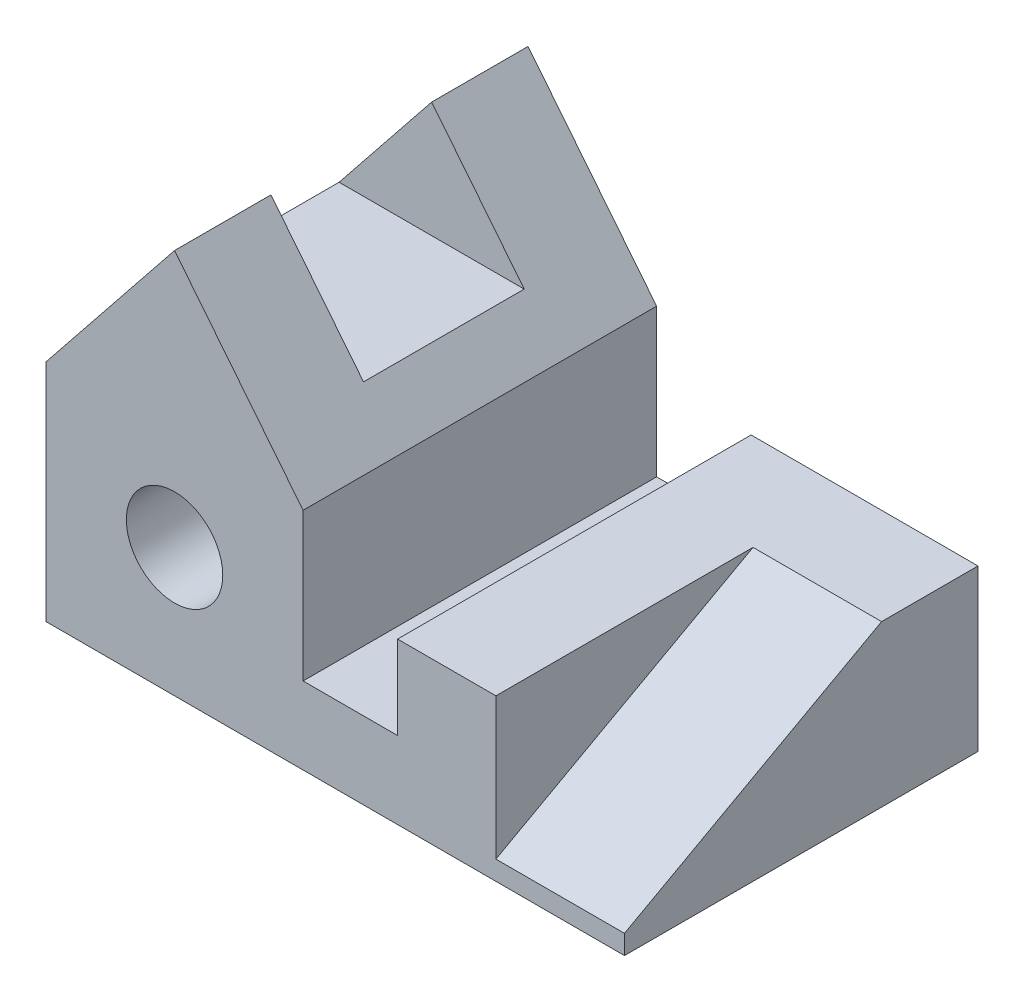
ISO-10303-21;
HEADER;
FILE_DESCRIPTION(('STEP AP214'),'2;1');
FILE_NAME('part.step','',(''),(''),'','','');
FILE_SCHEMA(('AUTOMOTIVE_DESIGN { 1 0 10303 214 1 1 1 1 }'));
ENDSEC;
DATA;
#1=APPLICATION_CONTEXT('core data for automotive mechanical design processes');
#2=APPLICATION_PROTOCOL_DEFINITION('international standard','automotive_design',2000,#1);
#3=PRODUCT_CONTEXT('',#1,'mechanical');
#4=PRODUCT('Part','Part','',(#3));
#5=PRODUCT_RELATED_PRODUCT_CATEGORY('part','',(#4));
#6=PRODUCT_DEFINITION_FORMATION('','',#4);
#7=PRODUCT_DEFINITION_CONTEXT('part definition',#1,'design');
#8=PRODUCT_DEFINITION('design','',#6,#7);
#9=PRODUCT_DEFINITION_SHAPE('','',#8);
#10=(LENGTH_UNIT() NAMED_UNIT(*) SI_UNIT(.MILLI.,.METRE.));
#11=(NAMED_UNIT(*) PLANE_ANGLE_UNIT() SI_UNIT($,.RADIAN.));
#12=(NAMED_UNIT(*) SI_UNIT($,.STERADIAN.) SOLID_ANGLE_UNIT());
#13=UNCERTAINTY_MEASURE_WITH_UNIT(LENGTH_MEASURE(1.E-05),#10,'distance_accuracy_value','');
#14=(GEOMETRIC_REPRESENTATION_CONTEXT(3) GLOBAL_UNCERTAINTY_ASSIGNED_CONTEXT((#13)) GLOBAL_UNIT_ASSIGNED_CONTEXT((#10,
#11,#12)) REPRESENTATION_CONTEXT('',''));
#15=CARTESIAN_POINT('',(0.,0.,0.));
#16=DIRECTION('',(0.,0.,1.));
#17=DIRECTION('',(1.,0.,0.));
#18=AXIS2_PLACEMENT_3D('',#15,#16,#17);
#19=CARTESIAN_POINT('',(-127.,889.,4551.25489909493));
#20=DIRECTION('',(0.78086880944303,0.624695047554424,0.));
#21=DIRECTION('',(-0.624695047554424,0.78086880944303,0.));
#22=AXIS2_PLACEMENT_3D('',#19,#20,#21);
#23=PLANE('',#22);
#24=DIRECTION('',(0.,0.,-1.));
#25=VECTOR('',#24,1.);
#26=CARTESIAN_POINT('',(-269.24,1066.8,317.5));
#27=LINE('',#26,#25);
#28=CARTESIAN_POINT('',(-269.24,1066.8,317.5));
#29=VERTEX_POINT('',#28);
#30=CARTESIAN_POINT('',(-269.24,1066.8,-317.5));
#31=VERTEX_POINT('',#30);
#32=EDGE_CURVE('E250',#29,#31,#27,.T.);
#33=ORIENTED_EDGE('',*,*,#32,.F.);
#34=DIRECTION('',(-0.624695047554424,0.78086880944303,0.));
#35=VECTOR('',#34,1.);
#36=CARTESIAN_POINT('',(-269.24,1066.8,317.5));
#37=LINE('',#36,#35);
#38=CARTESIAN_POINT('',(-635.,1524.,317.5));
#39=VERTEX_POINT('',#38);
#40=EDGE_CURVE('E239',#29,#39,#37,.T.);
#41=ORIENTED_EDGE('',*,*,#40,.T.);
#42=DIRECTION('',(0.,0.,-1.));
#43=VECTOR('',#42,1.);
#44=CARTESIAN_POINT('',(-635.,1524.,4551.25489909493));
#45=LINE('',#44,#43);
#46=CARTESIAN_POINT('',(-635.,1524.,698.5));
#47=VERTEX_POINT('',#46);
#48=EDGE_CURVE('E303',#47,#39,#45,.T.);
#49=ORIENTED_EDGE('',*,*,#48,.F.);
#50=DIRECTION('',(0.624695047554424,-0.78086880944303,0.));
#51=VECTOR('',#50,1.);
#52=CARTESIAN_POINT('',(-127.,889.,698.5));
#53=LINE('',#52,#51);
#54=CARTESIAN_POINT('',(-127.,889.,698.5));
#55=VERTEX_POINT('',#54);
#56=EDGE_CURVE('E271',#47,#55,#53,.T.);
#57=ORIENTED_EDGE('',*,*,#56,.T.);
#58=DIRECTION('',(0.,0.,-1.));
#59=VECTOR('',#58,1.);
#60=CARTESIAN_POINT('',(-127.,889.,4551.25489909493));
#61=LINE('',#60,#59);
#62=CARTESIAN_POINT('',(-127.,889.,-698.5));
#63=VERTEX_POINT('',#62);
#64=EDGE_CURVE('E307',#55,#63,#61,.T.);
#65=ORIENTED_EDGE('',*,*,#64,.T.);
#66=DIRECTION('',(0.624695047554424,-0.78086880944303,0.));
#67=VECTOR('',#66,1.);
#68=CARTESIAN_POINT('',(-127.,889.,-698.5));
#69=LINE('',#68,#67);
#70=CARTESIAN_POINT('',(-635.,1524.,-698.5));
#71=VERTEX_POINT('',#70);
#72=EDGE_CURVE('E279',#71,#63,#69,.T.);
#73=ORIENTED_EDGE('',*,*,#72,.F.);
#74=CARTESIAN_POINT('',(-635.,1524.,-317.5));
#75=VERTEX_POINT('',#74);
#76=EDGE_CURVE('E302',#75,#71,#45,.T.);
#77=ORIENTED_EDGE('',*,*,#76,.F.);
#78=DIRECTION('',(-0.624695047554424,0.78086880944303,0.));
#79=VECTOR('',#78,1.);
#80=CARTESIAN_POINT('',(-269.24,1066.8,-317.5));
#81=LINE('',#80,#79);
#82=EDGE_CURVE('E70',#31,#75,#81,.T.);
#83=ORIENTED_EDGE('',*,*,#82,.F.);
#84=EDGE_LOOP('',(#33,#41,#49,#57,#65,#73,#77,#83));
#85=FACE_BOUND('',#84,.T.);
#86=ADVANCED_FACE('F44',(#85),#23,.T.);
#87=CARTESIAN_POINT('',(-1143.,889.,4551.25489909493));
#88=DIRECTION('',(-0.78086880944303,0.624695047554424,0.));
#89=DIRECTION('',(-0.624695047554424,-0.78086880944303,0.));
#90=AXIS2_PLACEMENT_3D('',#87,#88,#89);
#91=PLANE('',#90);
#92=ORIENTED_EDGE('',*,*,#48,.T.);
#93=DIRECTION('',(-0.624695047554424,-0.78086880944303,0.));
#94=VECTOR('',#93,1.);
#95=CARTESIAN_POINT('',(-1000.76,1066.8,317.5));
#96=LINE('',#95,#94);
#97=CARTESIAN_POINT('',(-1000.76,1066.8,317.5));
#98=VERTEX_POINT('',#97);
#99=EDGE_CURVE('E243',#39,#98,#96,.T.);
#100=ORIENTED_EDGE('',*,*,#99,.T.);
#101=DIRECTION('',(0.,0.,-1.));
#102=VECTOR('',#101,1.);
#103=CARTESIAN_POINT('',(-1000.76,1066.8,317.5));
#104=LINE('',#103,#102);
#105=CARTESIAN_POINT('',(-1000.76,1066.8,-317.5));
#106=VERTEX_POINT('',#105);
#107=EDGE_CURVE('E253',#98,#106,#104,.T.);
#108=ORIENTED_EDGE('',*,*,#107,.T.);
#109=DIRECTION('',(-0.624695047554424,-0.78086880944303,0.));
#110=VECTOR('',#109,1.);
#111=CARTESIAN_POINT('',(-1000.76,1066.8,-317.5));
#112=LINE('',#111,#110);
#113=EDGE_CURVE('E233',#75,#106,#112,.T.);
#114=ORIENTED_EDGE('',*,*,#113,.F.);
#115=ORIENTED_EDGE('',*,*,#76,.T.);
#116=DIRECTION('',(0.624695047554424,0.78086880944303,0.));
#117=VECTOR('',#116,1.);
#118=CARTESIAN_POINT('',(-1143.,889.,-698.5));
#119=LINE('',#118,#117);
#120=CARTESIAN_POINT('',(-1143.,889.,-698.5));
#121=VERTEX_POINT('',#120);
#122=EDGE_CURVE('E262',#121,#71,#119,.T.);
#123=ORIENTED_EDGE('',*,*,#122,.F.);
#124=DIRECTION('',(0.,0.,-1.));
#125=VECTOR('',#124,1.);
#126=CARTESIAN_POINT('',(-1143.,889.,4551.25489909493));
#127=LINE('',#126,#125);
#128=CARTESIAN_POINT('',(-1143.,889.,698.5));
#129=VERTEX_POINT('',#128);
#130=EDGE_CURVE('E299',#129,#121,#127,.T.);
#131=ORIENTED_EDGE('',*,*,#130,.F.);
#132=DIRECTION('',(0.624695047554424,0.78086880944303,0.));
#133=VECTOR('',#132,1.);
#134=CARTESIAN_POINT('',(-1143.,889.,698.5));
#135=LINE('',#134,#133);
#136=EDGE_CURVE('E187',#129,#47,#135,.T.);
#137=ORIENTED_EDGE('',*,*,#136,.T.);
#138=EDGE_LOOP('',(#92,#100,#108,#114,#115,#123,#131,#137));
#139=FACE_BOUND('',#138,.T.);
#140=ADVANCED_FACE('F338',(#139),#91,.T.);
#141=CARTESIAN_POINT('',(-1143.,1524.,698.5));
#142=DIRECTION('',(-1.,0.,0.));
#143=DIRECTION('',(0.,0.,1.));
#144=AXIS2_PLACEMENT_3D('',#141,#142,#143);
#145=PLANE('',#144);
#146=DIRECTION('',(0.,-1.,0.));
#147=VECTOR('',#146,1.);
#148=CARTESIAN_POINT('',(-1143.,1524.,698.5));
#149=LINE('',#148,#147);
#150=CARTESIAN_POINT('',(-1143.,0.,698.5));
#151=VERTEX_POINT('',#150);
#152=EDGE_CURVE('E48',#129,#151,#149,.T.);
#153=ORIENTED_EDGE('',*,*,#152,.F.);
#154=ORIENTED_EDGE('',*,*,#130,.T.);
#155=DIRECTION('',(0.,-1.,0.));
#156=VECTOR('',#155,1.);
#157=CARTESIAN_POINT('',(-1143.,1524.,-698.5));
#158=LINE('',#157,#156);
#159=CARTESIAN_POINT('',(-1143.,0.,-698.5));
#160=VERTEX_POINT('',#159);
#161=EDGE_CURVE('E200',#121,#160,#158,.T.);
#162=ORIENTED_EDGE('',*,*,#161,.T.);
#163=DIRECTION('',(0.,0.,-1.));
#164=VECTOR('',#163,1.);
#165=CARTESIAN_POINT('',(-1143.,0.,698.5));
#166=LINE('',#165,#164);
#167=EDGE_CURVE('E186',#151,#160,#166,.T.);
#168=ORIENTED_EDGE('',*,*,#167,.F.);
#169=EDGE_LOOP('',(#153,#154,#162,#168));
#170=FACE_BOUND('',#169,.T.);
#171=ADVANCED_FACE('F212',(#170),#145,.T.);
#172=CARTESIAN_POINT('',(-1143.,1524.,-698.5));
#173=DIRECTION('',(0.,0.,-1.));
#174=DIRECTION('',(-1.,0.,0.));
#175=AXIS2_PLACEMENT_3D('',#172,#173,#174);
#176=PLANE('',#175);
#177=CARTESIAN_POINT('',(-635.,508.,-698.5));
#178=DIRECTION('',(0.,0.,1.));
#179=DIRECTION('',(1.,0.,0.));
#180=AXIS2_PLACEMENT_3D('',#177,#178,#179);
#181=CIRCLE('',#180,190.5);
#182=CARTESIAN_POINT('',(-444.5,508.,-698.5));
#183=VERTEX_POINT('',#182);
#184=EDGE_CURVE('E258',#183,#183,#181,.T.);
#185=ORIENTED_EDGE('',*,*,#184,.T.);
#186=EDGE_LOOP('',(#185));
#187=FACE_BOUND('',#186,.T.);
#188=ORIENTED_EDGE('',*,*,#122,.T.);
#189=ORIENTED_EDGE('',*,*,#72,.T.);
#190=DIRECTION('',(0.,-1.,0.));
#191=VECTOR('',#190,1.);
#192=CARTESIAN_POINT('',(-127.,889.,-698.5));
#193=LINE('',#192,#191);
#194=CARTESIAN_POINT('',(-127.,304.8,-698.5));
#195=VERTEX_POINT('',#194);
#196=EDGE_CURVE('E283',#63,#195,#193,.T.);
#197=ORIENTED_EDGE('',*,*,#196,.T.);
#198=DIRECTION('',(1.,0.,0.));
#199=VECTOR('',#198,1.);
#200=CARTESIAN_POINT('',(-127.,304.8,-698.5));
#201=LINE('',#200,#199);
#202=CARTESIAN_POINT('',(246.405498815878,304.8,-698.5));
#203=VERTEX_POINT('',#202);
#204=EDGE_CURVE('E287',#195,#203,#201,.T.);
#205=ORIENTED_EDGE('',*,*,#204,.T.);
#206=DIRECTION('',(0.,1.,0.));
#207=VECTOR('',#206,1.);
#208=CARTESIAN_POINT('',(246.405498815878,304.8,-698.5));
#209=LINE('',#208,#207);
#210=CARTESIAN_POINT('',(246.405498815878,635.,-698.5));
#211=VERTEX_POINT('',#210);
#212=EDGE_CURVE('E291',#203,#211,#209,.T.);
#213=ORIENTED_EDGE('',*,*,#212,.T.);
#214=DIRECTION('',(1.,0.,0.));
#215=VECTOR('',#214,1.);
#216=CARTESIAN_POINT('',(246.405498815878,635.,-698.5));
#217=LINE('',#216,#215);
#218=CARTESIAN_POINT('',(1143.,635.,-698.5));
#219=VERTEX_POINT('',#218);
#220=EDGE_CURVE('E295',#211,#219,#217,.T.);
#221=ORIENTED_EDGE('',*,*,#220,.T.);
#222=DIRECTION('',(0.,-1.,0.));
#223=VECTOR('',#222,1.);
#224=CARTESIAN_POINT('',(1143.,1524.,-698.5));
#225=LINE('',#224,#223);
#226=CARTESIAN_POINT('',(1143.,0.,-698.5));
#227=VERTEX_POINT('',#226);
#228=EDGE_CURVE('E54',#219,#227,#225,.T.);
#229=ORIENTED_EDGE('',*,*,#228,.T.);
#230=DIRECTION('',(1.,0.,0.));
#231=VECTOR('',#230,1.);
#232=CARTESIAN_POINT('',(-1143.,0.,-698.5));
#233=LINE('',#232,#231);
#234=EDGE_CURVE('E191',#160,#227,#233,.T.);
#235=ORIENTED_EDGE('',*,*,#234,.F.);
#236=ORIENTED_EDGE('',*,*,#161,.F.);
#237=EDGE_LOOP('',(#188,#189,#197,#205,#213,#221,#229,#235,#236));
#238=FACE_BOUND('',#237,.T.);
#239=ADVANCED_FACE('F319',(#187,#238),#176,.T.);
#240=CARTESIAN_POINT('',(1143.,1524.,698.5));
#241=DIRECTION('',(0.,0.,1.));
#242=DIRECTION('',(1.,0.,0.));
#243=AXIS2_PLACEMENT_3D('',#240,#241,#242);
#244=PLANE('',#243);
#245=DIRECTION('',(1.,0.,0.));
#246=VECTOR('',#245,1.);
#247=CARTESIAN_POINT('',(635.000000000001,76.2,698.5));
#248=LINE('',#247,#246);
#249=CARTESIAN_POINT('',(635.000000000001,76.2,698.5));
#250=VERTEX_POINT('',#249);
#251=CARTESIAN_POINT('',(1143.,76.2,698.5));
#252=VERTEX_POINT('',#251);
#253=EDGE_CURVE('E164',#250,#252,#248,.T.);
#254=ORIENTED_EDGE('',*,*,#253,.F.);
#255=DIRECTION('',(0.,-1.,0.));
#256=VECTOR('',#255,1.);
#257=CARTESIAN_POINT('',(635.000000000001,635.,698.5));
#258=LINE('',#257,#256);
#259=CARTESIAN_POINT('',(635.000000000001,635.,698.5));
#260=VERTEX_POINT('',#259);
#261=EDGE_CURVE('E150',#260,#250,#258,.T.);
#262=ORIENTED_EDGE('',*,*,#261,.F.);
#263=DIRECTION('',(1.,0.,0.));
#264=VECTOR('',#263,1.);
#265=CARTESIAN_POINT('',(246.405498815878,635.,698.5));
#266=LINE('',#265,#264);
#267=CARTESIAN_POINT('',(246.405498815878,635.,698.5));
#268=VERTEX_POINT('',#267);
#269=EDGE_CURVE('E162',#268,#260,#266,.T.);
#270=ORIENTED_EDGE('',*,*,#269,.F.);
#271=DIRECTION('',(0.,1.,0.));
#272=VECTOR('',#271,1.);
#273=CARTESIAN_POINT('',(246.405498815878,304.8,698.5));
#274=LINE('',#273,#272);
#275=CARTESIAN_POINT('',(246.405498815878,304.8,698.5));
#276=VERTEX_POINT('',#275);
#277=EDGE_CURVE('E172',#276,#268,#274,.T.);
#278=ORIENTED_EDGE('',*,*,#277,.F.);
#279=DIRECTION('',(1.,0.,0.));
#280=VECTOR('',#279,1.);
#281=CARTESIAN_POINT('',(-127.,304.8,698.5));
#282=LINE('',#281,#280);
#283=CARTESIAN_POINT('',(-127.,304.8,698.5));
#284=VERTEX_POINT('',#283);
#285=EDGE_CURVE('E176',#284,#276,#282,.T.);
#286=ORIENTED_EDGE('',*,*,#285,.F.);
#287=DIRECTION('',(0.,-1.,0.));
#288=VECTOR('',#287,1.);
#289=CARTESIAN_POINT('',(-127.,889.,698.5));
#290=LINE('',#289,#288);
#291=EDGE_CURVE('E268',#55,#284,#290,.T.);
#292=ORIENTED_EDGE('',*,*,#291,.F.);
#293=ORIENTED_EDGE('',*,*,#56,.F.);
#294=ORIENTED_EDGE('',*,*,#136,.F.);
#295=ORIENTED_EDGE('',*,*,#152,.T.);
#296=DIRECTION('',(-1.,0.,0.));
#297=VECTOR('',#296,1.);
#298=CARTESIAN_POINT('',(1143.,0.,698.5));
#299=LINE('',#298,#297);
#300=CARTESIAN_POINT('',(1143.,0.,698.5));
#301=VERTEX_POINT('',#300);
#302=EDGE_CURVE('E182',#301,#151,#299,.T.);
#303=ORIENTED_EDGE('',*,*,#302,.F.);
#304=DIRECTION('',(0.,-1.,0.));
#305=VECTOR('',#304,1.);
#306=CARTESIAN_POINT('',(1143.,1524.,698.5));
#307=LINE('',#306,#305);
#308=EDGE_CURVE('E11',#252,#301,#307,.T.);
#309=ORIENTED_EDGE('',*,*,#308,.F.);
#310=EDGE_LOOP('',(#254,#262,#270,#278,#286,#292,#293,#294,#295,#303,#309));
#311=FACE_BOUND('',#310,.T.);
#312=CARTESIAN_POINT('',(-635.,508.,698.5));
#313=DIRECTION('',(0.,0.,1.));
#314=DIRECTION('',(1.,0.,0.));
#315=AXIS2_PLACEMENT_3D('',#312,#313,#314);
#316=CIRCLE('',#315,190.5);
#317=CARTESIAN_POINT('',(-444.5,508.,698.5));
#318=VERTEX_POINT('',#317);
#319=EDGE_CURVE('E257',#318,#318,#316,.T.);
#320=ORIENTED_EDGE('',*,*,#319,.F.);
#321=EDGE_LOOP('',(#320));
#322=FACE_BOUND('',#321,.T.);
#323=ADVANCED_FACE('F46',(#311,#322),#244,.T.);
#324=CARTESIAN_POINT('',(1143.,1524.,-698.5));
#325=DIRECTION('',(1.,0.,0.));
#326=DIRECTION('',(0.,0.,-1.));
#327=AXIS2_PLACEMENT_3D('',#324,#325,#326);
#328=PLANE('',#327);
#329=DIRECTION('',(0.,0.481918749772156,-0.876215908676647));
#330=VECTOR('',#329,1.);
#331=CARTESIAN_POINT('',(1143.,635.,-317.5));
#332=LINE('',#331,#330);
#333=CARTESIAN_POINT('',(1143.,635.,-317.5));
#334=VERTEX_POINT('',#333);
#335=EDGE_CURVE('E155',#252,#334,#332,.T.);
#336=ORIENTED_EDGE('',*,*,#335,.F.);
#337=ORIENTED_EDGE('',*,*,#308,.T.);
#338=DIRECTION('',(0.,0.,1.));
#339=VECTOR('',#338,1.);
#340=CARTESIAN_POINT('',(1143.,0.,-698.5));
#341=LINE('',#340,#339);
#342=EDGE_CURVE('E195',#227,#301,#341,.T.);
#343=ORIENTED_EDGE('',*,*,#342,.F.);
#344=ORIENTED_EDGE('',*,*,#228,.F.);
#345=DIRECTION('',(0.,0.,-1.));
#346=VECTOR('',#345,1.);
#347=CARTESIAN_POINT('',(1143.,635.,4551.25489909493));
#348=LINE('',#347,#346);
#349=EDGE_CURVE('E178',#334,#219,#348,.T.);
#350=ORIENTED_EDGE('',*,*,#349,.F.);
#351=EDGE_LOOP('',(#336,#337,#343,#344,#350));
#352=FACE_BOUND('',#351,.T.);
#353=ADVANCED_FACE('F219',(#352),#328,.T.);
#354=CARTESIAN_POINT('',(0.,0.,0.));
#355=DIRECTION('',(0.,-1.,0.));
#356=DIRECTION('',(0.,0.,-1.));
#357=AXIS2_PLACEMENT_3D('',#354,#355,#356);
#358=PLANE('',#357);
#359=ORIENTED_EDGE('',*,*,#302,.T.);
#360=ORIENTED_EDGE('',*,*,#167,.T.);
#361=ORIENTED_EDGE('',*,*,#234,.T.);
#362=ORIENTED_EDGE('',*,*,#342,.T.);
#363=EDGE_LOOP('',(#359,#360,#361,#362));
#364=FACE_BOUND('',#363,.T.);
#365=ADVANCED_FACE('F214',(#364),#358,.T.);
#366=CARTESIAN_POINT('',(246.405498815878,635.,4551.25489909493));
#367=DIRECTION('',(0.,1.,0.));
#368=DIRECTION('',(0.,0.,1.));
#369=AXIS2_PLACEMENT_3D('',#366,#367,#368);
#370=PLANE('',#369);
#371=DIRECTION('',(1.,0.,0.));
#372=VECTOR('',#371,1.);
#373=CARTESIAN_POINT('',(635.,635.,-317.5));
#374=LINE('',#373,#372);
#375=CARTESIAN_POINT('',(635.,635.,-317.5));
#376=VERTEX_POINT('',#375);
#377=EDGE_CURVE('E226',#376,#334,#374,.T.);
#378=ORIENTED_EDGE('',*,*,#377,.T.);
#379=ORIENTED_EDGE('',*,*,#349,.T.);
#380=ORIENTED_EDGE('',*,*,#220,.F.);
#381=DIRECTION('',(0.,0.,-1.));
#382=VECTOR('',#381,1.);
#383=CARTESIAN_POINT('',(246.405498815878,635.,4551.25489909493));
#384=LINE('',#383,#382);
#385=EDGE_CURVE('E170',#268,#211,#384,.T.);
#386=ORIENTED_EDGE('',*,*,#385,.F.);
#387=ORIENTED_EDGE('',*,*,#269,.T.);
#388=DIRECTION('',(0.,0.,1.));
#389=VECTOR('',#388,1.);
#390=CARTESIAN_POINT('',(635.,635.,-317.5));
#391=LINE('',#390,#389);
#392=EDGE_CURVE('E147',#376,#260,#391,.T.);
#393=ORIENTED_EDGE('',*,*,#392,.F.);
#394=EDGE_LOOP('',(#378,#379,#380,#386,#387,#393));
#395=FACE_BOUND('',#394,.T.);
#396=ADVANCED_FACE('F168',(#395),#370,.T.);
#397=CARTESIAN_POINT('',(246.405498815878,304.8,4551.25489909493));
#398=DIRECTION('',(-1.,0.,0.));
#399=DIRECTION('',(0.,0.,1.));
#400=AXIS2_PLACEMENT_3D('',#397,#398,#399);
#401=PLANE('',#400);
#402=DIRECTION('',(0.,0.,-1.));
#403=VECTOR('',#402,1.);
#404=CARTESIAN_POINT('',(246.405498815878,304.8,4551.25489909493));
#405=LINE('',#404,#403);
#406=EDGE_CURVE('E314',#276,#203,#405,.T.);
#407=ORIENTED_EDGE('',*,*,#406,.F.);
#408=ORIENTED_EDGE('',*,*,#277,.T.);
#409=ORIENTED_EDGE('',*,*,#385,.T.);
#410=ORIENTED_EDGE('',*,*,#212,.F.);
#411=EDGE_LOOP('',(#407,#408,#409,#410));
#412=FACE_BOUND('',#411,.T.);
#413=ADVANCED_FACE('F323',(#412),#401,.T.);
#414=CARTESIAN_POINT('',(-127.,304.8,4551.25489909493));
#415=DIRECTION('',(0.,1.,0.));
#416=DIRECTION('',(0.,0.,1.));
#417=AXIS2_PLACEMENT_3D('',#414,#415,#416);
#418=PLANE('',#417);
#419=DIRECTION('',(0.,0.,-1.));
#420=VECTOR('',#419,1.);
#421=CARTESIAN_POINT('',(-127.,304.8,4551.25489909493));
#422=LINE('',#421,#420);
#423=EDGE_CURVE('E311',#284,#195,#422,.T.);
#424=ORIENTED_EDGE('',*,*,#423,.F.);
#425=ORIENTED_EDGE('',*,*,#285,.T.);
#426=ORIENTED_EDGE('',*,*,#406,.T.);
#427=ORIENTED_EDGE('',*,*,#204,.F.);
#428=EDGE_LOOP('',(#424,#425,#426,#427));
#429=FACE_BOUND('',#428,.T.);
#430=ADVANCED_FACE('F326',(#429),#418,.T.);
#431=CARTESIAN_POINT('',(-127.,889.,4551.25489909493));
#432=DIRECTION('',(1.,0.,0.));
#433=DIRECTION('',(0.,1.,0.));
#434=AXIS2_PLACEMENT_3D('',#431,#432,#433);
#435=PLANE('',#434);
#436=ORIENTED_EDGE('',*,*,#64,.F.);
#437=ORIENTED_EDGE('',*,*,#291,.T.);
#438=ORIENTED_EDGE('',*,*,#423,.T.);
#439=ORIENTED_EDGE('',*,*,#196,.F.);
#440=EDGE_LOOP('',(#436,#437,#438,#439));
#441=FACE_BOUND('',#440,.T.);
#442=ADVANCED_FACE('F331',(#441),#435,.T.);
#443=CARTESIAN_POINT('',(-635.,508.,-698.5));
#444=DIRECTION('',(0.,0.,1.));
#445=DIRECTION('',(1.,0.,0.));
#446=AXIS2_PLACEMENT_3D('',#443,#444,#445);
#447=CYLINDRICAL_SURFACE('',#446,190.5);
#448=ORIENTED_EDGE('',*,*,#184,.F.);
#449=EDGE_LOOP('',(#448));
#450=FACE_BOUND('',#449,.T.);
#451=ORIENTED_EDGE('',*,*,#319,.T.);
#452=EDGE_LOOP('',(#451));
#453=FACE_BOUND('',#452,.T.);
#454=ADVANCED_FACE('F356',(#450,#453),#447,.F.);
#455=CARTESIAN_POINT('',(-635.,1066.8,317.5));
#456=DIRECTION('',(0.,1.,0.));
#457=DIRECTION('',(0.,0.,1.));
#458=AXIS2_PLACEMENT_3D('',#455,#456,#457);
#459=PLANE('',#458);
#460=ORIENTED_EDGE('',*,*,#107,.F.);
#461=DIRECTION('',(1.,0.,0.));
#462=VECTOR('',#461,1.);
#463=CARTESIAN_POINT('',(-635.,1066.8,317.5));
#464=LINE('',#463,#462);
#465=EDGE_CURVE('E247',#98,#29,#464,.T.);
#466=ORIENTED_EDGE('',*,*,#465,.T.);
#467=ORIENTED_EDGE('',*,*,#32,.T.);
#468=DIRECTION('',(1.,0.,0.));
#469=VECTOR('',#468,1.);
#470=CARTESIAN_POINT('',(-635.,1066.8,-317.5));
#471=LINE('',#470,#469);
#472=EDGE_CURVE('E236',#106,#31,#471,.T.);
#473=ORIENTED_EDGE('',*,*,#472,.F.);
#474=EDGE_LOOP('',(#460,#466,#467,#473));
#475=FACE_BOUND('',#474,.T.);
#476=ADVANCED_FACE('F343',(#475),#459,.T.);
#477=CARTESIAN_POINT('',(0.,0.,317.5));
#478=DIRECTION('',(0.,0.,-1.));
#479=DIRECTION('',(-1.,0.,0.));
#480=AXIS2_PLACEMENT_3D('',#477,#478,#479);
#481=PLANE('',#480);
#482=ORIENTED_EDGE('',*,*,#40,.F.);
#483=ORIENTED_EDGE('',*,*,#465,.F.);
#484=ORIENTED_EDGE('',*,*,#99,.F.);
#485=EDGE_LOOP('',(#482,#483,#484));
#486=FACE_BOUND('',#485,.T.);
#487=ADVANCED_FACE('F347',(#486),#481,.T.);
#488=CARTESIAN_POINT('',(0.,0.,-317.5));
#489=DIRECTION('',(0.,0.,-1.));
#490=DIRECTION('',(-1.,0.,0.));
#491=AXIS2_PLACEMENT_3D('',#488,#489,#490);
#492=PLANE('',#491);
#493=ORIENTED_EDGE('',*,*,#82,.T.);
#494=ORIENTED_EDGE('',*,*,#113,.T.);
#495=ORIENTED_EDGE('',*,*,#472,.T.);
#496=EDGE_LOOP('',(#493,#494,#495));
#497=FACE_BOUND('',#496,.T.);
#498=ADVANCED_FACE('F345',(#497),#492,.F.);
#499=CARTESIAN_POINT('',(635.,635.,-317.5));
#500=DIRECTION('',(0.,-0.876215908676647,-0.481918749772156));
#501=DIRECTION('',(0.,0.481918749772156,-0.876215908676647));
#502=AXIS2_PLACEMENT_3D('',#499,#500,#501);
#503=PLANE('',#502);
#504=ORIENTED_EDGE('',*,*,#335,.T.);
#505=ORIENTED_EDGE('',*,*,#377,.F.);
#506=DIRECTION('',(0.,0.481918749772156,-0.876215908676647));
#507=VECTOR('',#506,1.);
#508=CARTESIAN_POINT('',(635.,635.,-317.5));
#509=LINE('',#508,#507);
#510=EDGE_CURVE('E62',#250,#376,#509,.T.);
#511=ORIENTED_EDGE('',*,*,#510,.F.);
#512=ORIENTED_EDGE('',*,*,#253,.T.);
#513=EDGE_LOOP('',(#504,#505,#511,#512));
#514=FACE_BOUND('',#513,.T.);
#515=ADVANCED_FACE('F354',(#514),#503,.F.);
#516=CARTESIAN_POINT('',(635.,0.,0.));
#517=DIRECTION('',(1.,0.,0.));
#518=DIRECTION('',(0.,0.,-1.));
#519=AXIS2_PLACEMENT_3D('',#516,#517,#518);
#520=PLANE('',#519);
#521=ORIENTED_EDGE('',*,*,#392,.T.);
#522=ORIENTED_EDGE('',*,*,#261,.T.);
#523=ORIENTED_EDGE('',*,*,#510,.T.);
#524=EDGE_LOOP('',(#521,#522,#523));
#525=FACE_BOUND('',#524,.T.);
#526=ADVANCED_FACE('F149',(#525),#520,.T.);
#527=CLOSED_SHELL('',(#86,#140,#171,#239,#323,#353,#365,#396,#413,#430,#442,#454,#476,#487,#498,
#515,#526));
#528=MANIFOLD_SOLID_BREP('B2',#527);
#529=ADVANCED_BREP_SHAPE_REPRESENTATION('',(#18,#528),#14);
#530=SHAPE_DEFINITION_REPRESENTATION(#9,#529);
ENDSEC;
END-ISO-10303-21;
